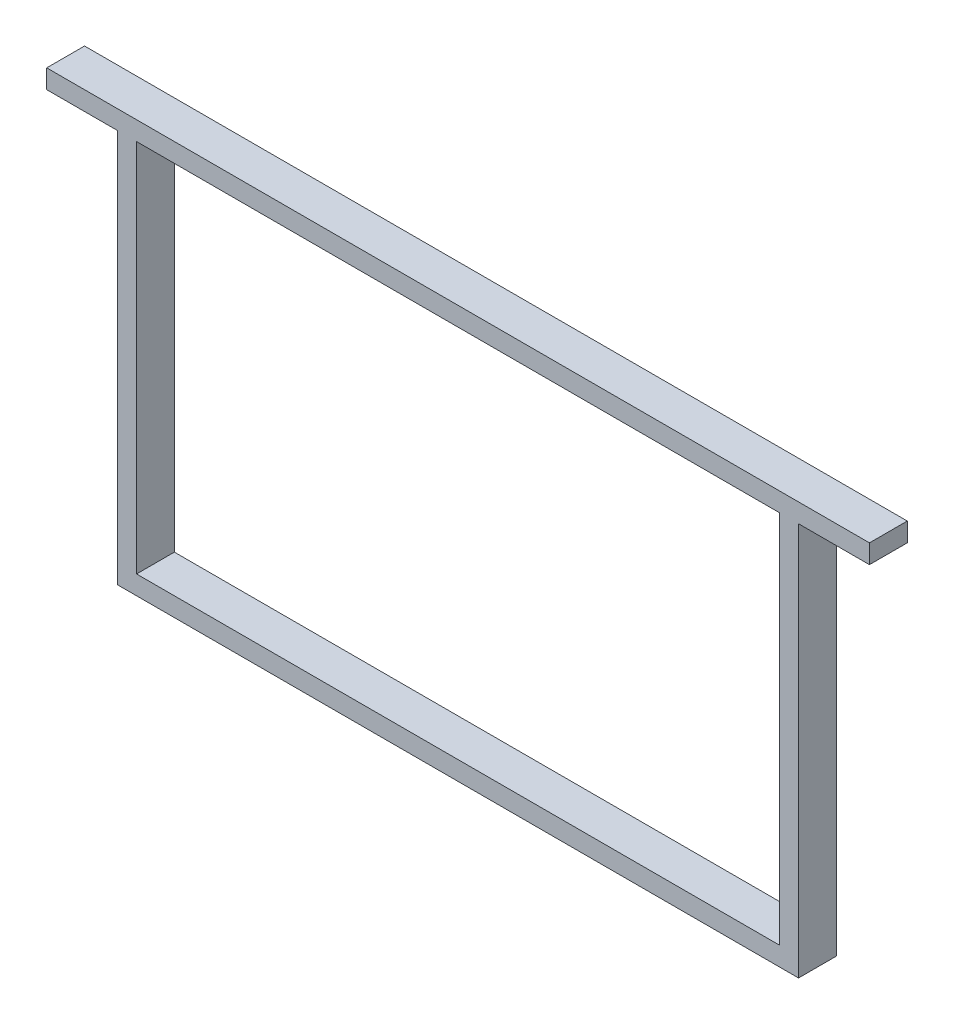
ISO-10303-21;
HEADER;
FILE_DESCRIPTION(('STEP AP214'),'2;1');
FILE_NAME('part.step','',(''),(''),'','','');
FILE_SCHEMA(('AUTOMOTIVE_DESIGN { 1 0 10303 214 1 1 1 1 }'));
ENDSEC;
DATA;
#1=APPLICATION_CONTEXT('core data for automotive mechanical design processes');
#2=APPLICATION_PROTOCOL_DEFINITION('international standard','automotive_design',2000,#1);
#3=PRODUCT_CONTEXT('',#1,'mechanical');
#4=PRODUCT('Part','Part','',(#3));
#5=PRODUCT_RELATED_PRODUCT_CATEGORY('part','',(#4));
#6=PRODUCT_DEFINITION_FORMATION('','',#4);
#7=PRODUCT_DEFINITION_CONTEXT('part definition',#1,'design');
#8=PRODUCT_DEFINITION('design','',#6,#7);
#9=PRODUCT_DEFINITION_SHAPE('','',#8);
#10=(LENGTH_UNIT() NAMED_UNIT(*) SI_UNIT(.MILLI.,.METRE.));
#11=(NAMED_UNIT(*) PLANE_ANGLE_UNIT() SI_UNIT($,.RADIAN.));
#12=(NAMED_UNIT(*) SI_UNIT($,.STERADIAN.) SOLID_ANGLE_UNIT());
#13=UNCERTAINTY_MEASURE_WITH_UNIT(LENGTH_MEASURE(1.E-05),#10,'distance_accuracy_value','');
#14=(GEOMETRIC_REPRESENTATION_CONTEXT(3) GLOBAL_UNCERTAINTY_ASSIGNED_CONTEXT((#13)) GLOBAL_UNIT_ASSIGNED_CONTEXT((#10,
#11,#12)) REPRESENTATION_CONTEXT('',''));
#15=CARTESIAN_POINT('',(0.,0.,0.));
#16=DIRECTION('',(0.,0.,1.));
#17=DIRECTION('',(1.,0.,0.));
#18=AXIS2_PLACEMENT_3D('',#15,#16,#17);
#19=CARTESIAN_POINT('',(-180.,0.,20.));
#20=DIRECTION('',(-1.,0.,0.));
#21=DIRECTION('',(0.,0.,1.));
#22=AXIS2_PLACEMENT_3D('',#19,#20,#21);
#23=PLANE('',#22);
#24=DIRECTION('',(0.,1.,0.));
#25=VECTOR('',#24,1.);
#26=CARTESIAN_POINT('',(-180.,0.,0.));
#27=LINE('',#26,#25);
#28=CARTESIAN_POINT('',(-180.,-109.,0.));
#29=VERTEX_POINT('',#28);
#30=CARTESIAN_POINT('',(-180.,99.,0.));
#31=VERTEX_POINT('',#30);
#32=EDGE_CURVE('E190',#29,#31,#27,.T.);
#33=ORIENTED_EDGE('',*,*,#32,.F.);
#34=DIRECTION('',(0.,0.,-1.));
#35=VECTOR('',#34,1.);
#36=CARTESIAN_POINT('',(-180.,-109.,20.));
#37=LINE('',#36,#35);
#38=CARTESIAN_POINT('',(-180.,-109.,20.));
#39=VERTEX_POINT('',#38);
#40=EDGE_CURVE('E11',#39,#29,#37,.T.);
#41=ORIENTED_EDGE('',*,*,#40,.F.);
#42=DIRECTION('',(0.,1.,0.));
#43=VECTOR('',#42,1.);
#44=CARTESIAN_POINT('',(-180.,0.,20.));
#45=LINE('',#44,#43);
#46=CARTESIAN_POINT('',(-180.,99.,20.));
#47=VERTEX_POINT('',#46);
#48=EDGE_CURVE('E265',#39,#47,#45,.T.);
#49=ORIENTED_EDGE('',*,*,#48,.T.);
#50=DIRECTION('',(0.,0.,-1.));
#51=VECTOR('',#50,1.);
#52=CARTESIAN_POINT('',(-180.,99.,20.));
#53=LINE('',#52,#51);
#54=EDGE_CURVE('E63',#47,#31,#53,.T.);
#55=ORIENTED_EDGE('',*,*,#54,.T.);
#56=EDGE_LOOP('',(#33,#41,#49,#55));
#57=FACE_BOUND('',#56,.T.);
#58=ADVANCED_FACE('F43',(#57),#23,.T.);
#59=CARTESIAN_POINT('',(0.,-109.,20.));
#60=DIRECTION('',(0.,1.,0.));
#61=DIRECTION('',(0.,0.,1.));
#62=AXIS2_PLACEMENT_3D('',#59,#60,#61);
#63=PLANE('',#62);
#64=DIRECTION('',(1.,0.,0.));
#65=VECTOR('',#64,1.);
#66=CARTESIAN_POINT('',(0.,-109.,0.));
#67=LINE('',#66,#65);
#68=CARTESIAN_POINT('',(180.,-109.,0.));
#69=VERTEX_POINT('',#68);
#70=EDGE_CURVE('E193',#29,#69,#67,.T.);
#71=ORIENTED_EDGE('',*,*,#70,.T.);
#72=DIRECTION('',(0.,0.,-1.));
#73=VECTOR('',#72,1.);
#74=CARTESIAN_POINT('',(180.,-109.,20.));
#75=LINE('',#74,#73);
#76=CARTESIAN_POINT('',(180.,-109.,20.));
#77=VERTEX_POINT('',#76);
#78=EDGE_CURVE('E54',#77,#69,#75,.T.);
#79=ORIENTED_EDGE('',*,*,#78,.F.);
#80=DIRECTION('',(1.,0.,0.));
#81=VECTOR('',#80,1.);
#82=CARTESIAN_POINT('',(0.,-109.,20.));
#83=LINE('',#82,#81);
#84=EDGE_CURVE('E270',#39,#77,#83,.T.);
#85=ORIENTED_EDGE('',*,*,#84,.F.);
#86=ORIENTED_EDGE('',*,*,#40,.T.);
#87=EDGE_LOOP('',(#71,#79,#85,#86));
#88=FACE_BOUND('',#87,.T.);
#89=ADVANCED_FACE('F302',(#88),#63,.F.);
#90=CARTESIAN_POINT('',(180.,0.,20.));
#91=DIRECTION('',(-1.,0.,0.));
#92=DIRECTION('',(0.,0.,1.));
#93=AXIS2_PLACEMENT_3D('',#90,#91,#92);
#94=PLANE('',#93);
#95=DIRECTION('',(0.,1.,0.));
#96=VECTOR('',#95,1.);
#97=CARTESIAN_POINT('',(180.,0.,0.));
#98=LINE('',#97,#96);
#99=CARTESIAN_POINT('',(180.,99.,0.));
#100=VERTEX_POINT('',#99);
#101=EDGE_CURVE('E197',#69,#100,#98,.T.);
#102=ORIENTED_EDGE('',*,*,#101,.T.);
#103=DIRECTION('',(0.,0.,-1.));
#104=VECTOR('',#103,1.);
#105=CARTESIAN_POINT('',(180.,99.,20.));
#106=LINE('',#105,#104);
#107=CARTESIAN_POINT('',(180.,99.,20.));
#108=VERTEX_POINT('',#107);
#109=EDGE_CURVE('E228',#108,#100,#106,.T.);
#110=ORIENTED_EDGE('',*,*,#109,.F.);
#111=DIRECTION('',(0.,1.,0.));
#112=VECTOR('',#111,1.);
#113=CARTESIAN_POINT('',(180.,0.,20.));
#114=LINE('',#113,#112);
#115=EDGE_CURVE('E278',#77,#108,#114,.T.);
#116=ORIENTED_EDGE('',*,*,#115,.F.);
#117=ORIENTED_EDGE('',*,*,#78,.T.);
#118=EDGE_LOOP('',(#102,#110,#116,#117));
#119=FACE_BOUND('',#118,.T.);
#120=ADVANCED_FACE('F307',(#119),#94,.F.);
#121=CARTESIAN_POINT('',(0.,99.,20.));
#122=DIRECTION('',(0.,1.,0.));
#123=DIRECTION('',(0.,0.,1.));
#124=AXIS2_PLACEMENT_3D('',#121,#122,#123);
#125=PLANE('',#124);
#126=DIRECTION('',(1.,0.,0.));
#127=VECTOR('',#126,1.);
#128=CARTESIAN_POINT('',(0.,99.,0.));
#129=LINE('',#128,#127);
#130=CARTESIAN_POINT('',(217.5,99.,0.));
#131=VERTEX_POINT('',#130);
#132=EDGE_CURVE('E201',#100,#131,#129,.T.);
#133=ORIENTED_EDGE('',*,*,#132,.T.);
#134=DIRECTION('',(0.,0.,-1.));
#135=VECTOR('',#134,1.);
#136=CARTESIAN_POINT('',(217.5,99.,20.));
#137=LINE('',#136,#135);
#138=CARTESIAN_POINT('',(217.5,99.,20.));
#139=VERTEX_POINT('',#138);
#140=EDGE_CURVE('E225',#139,#131,#137,.T.);
#141=ORIENTED_EDGE('',*,*,#140,.F.);
#142=DIRECTION('',(1.,0.,0.));
#143=VECTOR('',#142,1.);
#144=CARTESIAN_POINT('',(0.,99.,20.));
#145=LINE('',#144,#143);
#146=EDGE_CURVE('E168',#108,#139,#145,.T.);
#147=ORIENTED_EDGE('',*,*,#146,.F.);
#148=ORIENTED_EDGE('',*,*,#109,.T.);
#149=EDGE_LOOP('',(#133,#141,#147,#148));
#150=FACE_BOUND('',#149,.T.);
#151=ADVANCED_FACE('F285',(#150),#125,.F.);
#152=CARTESIAN_POINT('',(217.500000000001,1.20736753927986E-12,20.));
#153=DIRECTION('',(1.,0.,0.));
#154=DIRECTION('',(0.,1.,0.));
#155=AXIS2_PLACEMENT_3D('',#152,#153,#154);
#156=PLANE('',#155);
#157=DIRECTION('',(0.,-1.,0.));
#158=VECTOR('',#157,1.);
#159=CARTESIAN_POINT('',(217.500000000001,1.20736753927986E-12,0.));
#160=LINE('',#159,#158);
#161=CARTESIAN_POINT('',(217.5,109.,0.));
#162=VERTEX_POINT('',#161);
#163=EDGE_CURVE('E205',#162,#131,#160,.T.);
#164=ORIENTED_EDGE('',*,*,#163,.F.);
#165=DIRECTION('',(0.,0.,-1.));
#166=VECTOR('',#165,1.);
#167=CARTESIAN_POINT('',(217.5,109.,20.));
#168=LINE('',#167,#166);
#169=CARTESIAN_POINT('',(217.5,109.,20.));
#170=VERTEX_POINT('',#169);
#171=EDGE_CURVE('E151',#170,#162,#168,.T.);
#172=ORIENTED_EDGE('',*,*,#171,.F.);
#173=DIRECTION('',(0.,-1.,0.));
#174=VECTOR('',#173,1.);
#175=CARTESIAN_POINT('',(217.500000000001,1.20736753927986E-12,20.));
#176=LINE('',#175,#174);
#177=EDGE_CURVE('E164',#170,#139,#176,.T.);
#178=ORIENTED_EDGE('',*,*,#177,.T.);
#179=ORIENTED_EDGE('',*,*,#140,.T.);
#180=EDGE_LOOP('',(#164,#172,#178,#179));
#181=FACE_BOUND('',#180,.T.);
#182=ADVANCED_FACE('F288',(#181),#156,.T.);
#183=CARTESIAN_POINT('',(0.,109.,20.));
#184=DIRECTION('',(0.,1.,0.));
#185=DIRECTION('',(-1.,0.,0.));
#186=AXIS2_PLACEMENT_3D('',#183,#184,#185);
#187=PLANE('',#186);
#188=DIRECTION('',(1.,0.,0.));
#189=VECTOR('',#188,1.);
#190=CARTESIAN_POINT('',(0.,109.,0.));
#191=LINE('',#190,#189);
#192=CARTESIAN_POINT('',(-217.5,109.,0.));
#193=VERTEX_POINT('',#192);
#194=EDGE_CURVE('E147',#193,#162,#191,.T.);
#195=ORIENTED_EDGE('',*,*,#194,.F.);
#196=DIRECTION('',(0.,0.,-1.));
#197=VECTOR('',#196,1.);
#198=CARTESIAN_POINT('',(-217.5,109.,20.));
#199=LINE('',#198,#197);
#200=CARTESIAN_POINT('',(-217.5,109.,20.));
#201=VERTEX_POINT('',#200);
#202=EDGE_CURVE('E141',#201,#193,#199,.T.);
#203=ORIENTED_EDGE('',*,*,#202,.F.);
#204=DIRECTION('',(1.,0.,0.));
#205=VECTOR('',#204,1.);
#206=CARTESIAN_POINT('',(0.,109.,20.));
#207=LINE('',#206,#205);
#208=EDGE_CURVE('E145',#201,#170,#207,.T.);
#209=ORIENTED_EDGE('',*,*,#208,.T.);
#210=ORIENTED_EDGE('',*,*,#171,.T.);
#211=EDGE_LOOP('',(#195,#203,#209,#210));
#212=FACE_BOUND('',#211,.T.);
#213=ADVANCED_FACE('F143',(#212),#187,.T.);
#214=CARTESIAN_POINT('',(-217.5,6.0368376963993E-13,20.));
#215=DIRECTION('',(1.,0.,0.));
#216=DIRECTION('',(0.,1.,0.));
#217=AXIS2_PLACEMENT_3D('',#214,#215,#216);
#218=PLANE('',#217);
#219=DIRECTION('',(0.,-1.,0.));
#220=VECTOR('',#219,1.);
#221=CARTESIAN_POINT('',(-217.5,6.0368376963993E-13,0.));
#222=LINE('',#221,#220);
#223=CARTESIAN_POINT('',(-217.5,99.,0.));
#224=VERTEX_POINT('',#223);
#225=EDGE_CURVE('E211',#193,#224,#222,.T.);
#226=ORIENTED_EDGE('',*,*,#225,.T.);
#227=DIRECTION('',(0.,0.,-1.));
#228=VECTOR('',#227,1.);
#229=CARTESIAN_POINT('',(-217.5,99.,20.));
#230=LINE('',#229,#228);
#231=CARTESIAN_POINT('',(-217.5,99.,20.));
#232=VERTEX_POINT('',#231);
#233=EDGE_CURVE('E101',#232,#224,#230,.T.);
#234=ORIENTED_EDGE('',*,*,#233,.F.);
#235=DIRECTION('',(0.,-1.,0.));
#236=VECTOR('',#235,1.);
#237=CARTESIAN_POINT('',(-217.5,6.0368376963993E-13,20.));
#238=LINE('',#237,#236);
#239=EDGE_CURVE('E153',#201,#232,#238,.T.);
#240=ORIENTED_EDGE('',*,*,#239,.F.);
#241=ORIENTED_EDGE('',*,*,#202,.T.);
#242=EDGE_LOOP('',(#226,#234,#240,#241));
#243=FACE_BOUND('',#242,.T.);
#244=ADVANCED_FACE('F154',(#243),#218,.F.);
#245=CARTESIAN_POINT('',(170.,0.,20.));
#246=DIRECTION('',(-1.,0.,0.));
#247=DIRECTION('',(0.,0.,1.));
#248=AXIS2_PLACEMENT_3D('',#245,#246,#247);
#249=PLANE('',#248);
#250=DIRECTION('',(0.,1.,0.));
#251=VECTOR('',#250,1.);
#252=CARTESIAN_POINT('',(170.,0.,0.));
#253=LINE('',#252,#251);
#254=CARTESIAN_POINT('',(170.,-99.,0.));
#255=VERTEX_POINT('',#254);
#256=CARTESIAN_POINT('',(170.,99.,0.));
#257=VERTEX_POINT('',#256);
#258=EDGE_CURVE('E175',#255,#257,#253,.T.);
#259=ORIENTED_EDGE('',*,*,#258,.F.);
#260=DIRECTION('',(0.,0.,-1.));
#261=VECTOR('',#260,1.);
#262=CARTESIAN_POINT('',(170.,-99.,20.));
#263=LINE('',#262,#261);
#264=CARTESIAN_POINT('',(170.,-99.,20.));
#265=VERTEX_POINT('',#264);
#266=EDGE_CURVE('E47',#265,#255,#263,.T.);
#267=ORIENTED_EDGE('',*,*,#266,.F.);
#268=DIRECTION('',(0.,1.,0.));
#269=VECTOR('',#268,1.);
#270=CARTESIAN_POINT('',(170.,0.,20.));
#271=LINE('',#270,#269);
#272=CARTESIAN_POINT('',(170.,99.,20.));
#273=VERTEX_POINT('',#272);
#274=EDGE_CURVE('E218',#265,#273,#271,.T.);
#275=ORIENTED_EDGE('',*,*,#274,.T.);
#276=DIRECTION('',(0.,0.,-1.));
#277=VECTOR('',#276,1.);
#278=CARTESIAN_POINT('',(170.,99.,20.));
#279=LINE('',#278,#277);
#280=EDGE_CURVE('E174',#273,#257,#279,.T.);
#281=ORIENTED_EDGE('',*,*,#280,.T.);
#282=EDGE_LOOP('',(#259,#267,#275,#281));
#283=FACE_BOUND('',#282,.T.);
#284=ADVANCED_FACE('F45',(#283),#249,.T.);
#285=CARTESIAN_POINT('',(0.,-99.,20.));
#286=DIRECTION('',(0.,1.,0.));
#287=DIRECTION('',(0.,0.,1.));
#288=AXIS2_PLACEMENT_3D('',#285,#286,#287);
#289=PLANE('',#288);
#290=DIRECTION('',(1.,0.,0.));
#291=VECTOR('',#290,1.);
#292=CARTESIAN_POINT('',(0.,-99.,0.));
#293=LINE('',#292,#291);
#294=CARTESIAN_POINT('',(-170.,-99.,0.));
#295=VERTEX_POINT('',#294);
#296=EDGE_CURVE('E179',#295,#255,#293,.T.);
#297=ORIENTED_EDGE('',*,*,#296,.F.);
#298=DIRECTION('',(0.,0.,-1.));
#299=VECTOR('',#298,1.);
#300=CARTESIAN_POINT('',(-170.,-99.,20.));
#301=LINE('',#300,#299);
#302=CARTESIAN_POINT('',(-170.,-99.,20.));
#303=VERTEX_POINT('',#302);
#304=EDGE_CURVE('E240',#303,#295,#301,.T.);
#305=ORIENTED_EDGE('',*,*,#304,.F.);
#306=DIRECTION('',(1.,0.,0.));
#307=VECTOR('',#306,1.);
#308=CARTESIAN_POINT('',(0.,-99.,20.));
#309=LINE('',#308,#307);
#310=EDGE_CURVE('E251',#303,#265,#309,.T.);
#311=ORIENTED_EDGE('',*,*,#310,.T.);
#312=ORIENTED_EDGE('',*,*,#266,.T.);
#313=EDGE_LOOP('',(#297,#305,#311,#312));
#314=FACE_BOUND('',#313,.T.);
#315=ADVANCED_FACE('F249',(#314),#289,.T.);
#316=CARTESIAN_POINT('',(-170.,0.,20.));
#317=DIRECTION('',(-1.,0.,0.));
#318=DIRECTION('',(0.,0.,1.));
#319=AXIS2_PLACEMENT_3D('',#316,#317,#318);
#320=PLANE('',#319);
#321=DIRECTION('',(0.,1.,0.));
#322=VECTOR('',#321,1.);
#323=CARTESIAN_POINT('',(-170.,0.,0.));
#324=LINE('',#323,#322);
#325=CARTESIAN_POINT('',(-170.,99.,0.));
#326=VERTEX_POINT('',#325);
#327=EDGE_CURVE('E183',#295,#326,#324,.T.);
#328=ORIENTED_EDGE('',*,*,#327,.T.);
#329=DIRECTION('',(0.,0.,-1.));
#330=VECTOR('',#329,1.);
#331=CARTESIAN_POINT('',(-170.,99.,20.));
#332=LINE('',#331,#330);
#333=CARTESIAN_POINT('',(-170.,99.,20.));
#334=VERTEX_POINT('',#333);
#335=EDGE_CURVE('E237',#334,#326,#332,.T.);
#336=ORIENTED_EDGE('',*,*,#335,.F.);
#337=DIRECTION('',(0.,1.,0.));
#338=VECTOR('',#337,1.);
#339=CARTESIAN_POINT('',(-170.,0.,20.));
#340=LINE('',#339,#338);
#341=EDGE_CURVE('E266',#303,#334,#340,.T.);
#342=ORIENTED_EDGE('',*,*,#341,.F.);
#343=ORIENTED_EDGE('',*,*,#304,.T.);
#344=EDGE_LOOP('',(#328,#336,#342,#343));
#345=FACE_BOUND('',#344,.T.);
#346=ADVANCED_FACE('F258',(#345),#320,.F.);
#347=CARTESIAN_POINT('',(0.,99.,20.));
#348=DIRECTION('',(0.,1.,0.));
#349=DIRECTION('',(0.,0.,1.));
#350=AXIS2_PLACEMENT_3D('',#347,#348,#349);
#351=PLANE('',#350);
#352=DIRECTION('',(1.,0.,0.));
#353=VECTOR('',#352,1.);
#354=CARTESIAN_POINT('',(0.,99.,0.));
#355=LINE('',#354,#353);
#356=EDGE_CURVE('E186',#326,#257,#355,.T.);
#357=ORIENTED_EDGE('',*,*,#356,.T.);
#358=ORIENTED_EDGE('',*,*,#280,.F.);
#359=DIRECTION('',(1.,0.,0.));
#360=VECTOR('',#359,1.);
#361=CARTESIAN_POINT('',(0.,99.,20.));
#362=LINE('',#361,#360);
#363=EDGE_CURVE('E262',#334,#273,#362,.T.);
#364=ORIENTED_EDGE('',*,*,#363,.F.);
#365=ORIENTED_EDGE('',*,*,#335,.T.);
#366=EDGE_LOOP('',(#357,#358,#364,#365));
#367=FACE_BOUND('',#366,.T.);
#368=ADVANCED_FACE('F261',(#367),#351,.F.);
#369=CARTESIAN_POINT('',(0.,99.,20.));
#370=DIRECTION('',(0.,-1.,0.));
#371=DIRECTION('',(0.,0.,-1.));
#372=AXIS2_PLACEMENT_3D('',#369,#370,#371);
#373=PLANE('',#372);
#374=DIRECTION('',(-1.,0.,0.));
#375=VECTOR('',#374,1.);
#376=CARTESIAN_POINT('',(0.,99.,0.));
#377=LINE('',#376,#375);
#378=EDGE_CURVE('E214',#31,#224,#377,.T.);
#379=ORIENTED_EDGE('',*,*,#378,.F.);
#380=ORIENTED_EDGE('',*,*,#54,.F.);
#381=DIRECTION('',(-1.,0.,0.));
#382=VECTOR('',#381,1.);
#383=CARTESIAN_POINT('',(0.,99.,20.));
#384=LINE('',#383,#382);
#385=EDGE_CURVE('E158',#47,#232,#384,.T.);
#386=ORIENTED_EDGE('',*,*,#385,.T.);
#387=ORIENTED_EDGE('',*,*,#233,.T.);
#388=EDGE_LOOP('',(#379,#380,#386,#387));
#389=FACE_BOUND('',#388,.T.);
#390=ADVANCED_FACE('F290',(#389),#373,.T.);
#391=CARTESIAN_POINT('',(0.,0.,20.));
#392=DIRECTION('',(0.,0.,1.));
#393=DIRECTION('',(1.,0.,0.));
#394=AXIS2_PLACEMENT_3D('',#391,#392,#393);
#395=PLANE('',#394);
#396=ORIENTED_EDGE('',*,*,#274,.F.);
#397=ORIENTED_EDGE('',*,*,#310,.F.);
#398=ORIENTED_EDGE('',*,*,#341,.T.);
#399=ORIENTED_EDGE('',*,*,#363,.T.);
#400=EDGE_LOOP('',(#396,#397,#398,#399));
#401=FACE_BOUND('',#400,.T.);
#402=ORIENTED_EDGE('',*,*,#48,.F.);
#403=ORIENTED_EDGE('',*,*,#84,.T.);
#404=ORIENTED_EDGE('',*,*,#115,.T.);
#405=ORIENTED_EDGE('',*,*,#146,.T.);
#406=ORIENTED_EDGE('',*,*,#177,.F.);
#407=ORIENTED_EDGE('',*,*,#208,.F.);
#408=ORIENTED_EDGE('',*,*,#239,.T.);
#409=ORIENTED_EDGE('',*,*,#385,.F.);
#410=EDGE_LOOP('',(#402,#403,#404,#405,#406,#407,#408,#409));
#411=FACE_BOUND('',#410,.T.);
#412=ADVANCED_FACE('F162',(#401,#411),#395,.T.);
#413=CARTESIAN_POINT('',(0.,0.,0.));
#414=DIRECTION('',(0.,0.,1.));
#415=DIRECTION('',(1.,0.,0.));
#416=AXIS2_PLACEMENT_3D('',#413,#414,#415);
#417=PLANE('',#416);
#418=ORIENTED_EDGE('',*,*,#258,.T.);
#419=ORIENTED_EDGE('',*,*,#356,.F.);
#420=ORIENTED_EDGE('',*,*,#327,.F.);
#421=ORIENTED_EDGE('',*,*,#296,.T.);
#422=EDGE_LOOP('',(#418,#419,#420,#421));
#423=FACE_BOUND('',#422,.T.);
#424=ORIENTED_EDGE('',*,*,#32,.T.);
#425=ORIENTED_EDGE('',*,*,#378,.T.);
#426=ORIENTED_EDGE('',*,*,#225,.F.);
#427=ORIENTED_EDGE('',*,*,#194,.T.);
#428=ORIENTED_EDGE('',*,*,#163,.T.);
#429=ORIENTED_EDGE('',*,*,#132,.F.);
#430=ORIENTED_EDGE('',*,*,#101,.F.);
#431=ORIENTED_EDGE('',*,*,#70,.F.);
#432=EDGE_LOOP('',(#424,#425,#426,#427,#428,#429,#430,#431));
#433=FACE_BOUND('',#432,.T.);
#434=ADVANCED_FACE('F255',(#423,#433),#417,.F.);
#435=CLOSED_SHELL('',(#58,#89,#120,#151,#182,#213,#244,#284,#315,#346,#368,#390,#412,#434));
#436=MANIFOLD_SOLID_BREP('B2',#435);
#437=ADVANCED_BREP_SHAPE_REPRESENTATION('',(#18,#436),#14);
#438=SHAPE_DEFINITION_REPRESENTATION(#9,#437);
ENDSEC;
END-ISO-10303-21;
